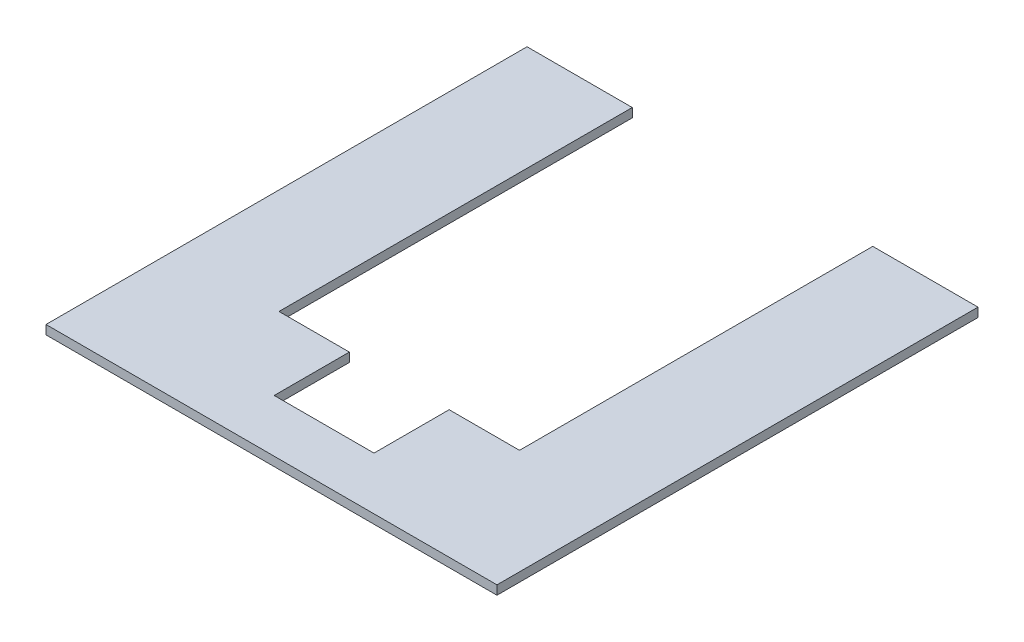
ISO-10303-21;
HEADER;
FILE_DESCRIPTION(('STEP AP214'),'2;1');
FILE_NAME('part.step','',(''),(''),'','','');
FILE_SCHEMA(('AUTOMOTIVE_DESIGN { 1 0 10303 214 1 1 1 1 }'));
ENDSEC;
DATA;
#1=APPLICATION_CONTEXT('core data for automotive mechanical design processes');
#2=APPLICATION_PROTOCOL_DEFINITION('international standard','automotive_design',2000,#1);
#3=PRODUCT_CONTEXT('',#1,'mechanical');
#4=PRODUCT('Part','Part','',(#3));
#5=PRODUCT_RELATED_PRODUCT_CATEGORY('part','',(#4));
#6=PRODUCT_DEFINITION_FORMATION('','',#4);
#7=PRODUCT_DEFINITION_CONTEXT('part definition',#1,'design');
#8=PRODUCT_DEFINITION('design','',#6,#7);
#9=PRODUCT_DEFINITION_SHAPE('','',#8);
#10=(LENGTH_UNIT() NAMED_UNIT(*) SI_UNIT(.MILLI.,.METRE.));
#11=(NAMED_UNIT(*) PLANE_ANGLE_UNIT() SI_UNIT($,.RADIAN.));
#12=(NAMED_UNIT(*) SI_UNIT($,.STERADIAN.) SOLID_ANGLE_UNIT());
#13=UNCERTAINTY_MEASURE_WITH_UNIT(LENGTH_MEASURE(1.E-05),#10,'distance_accuracy_value','');
#14=(GEOMETRIC_REPRESENTATION_CONTEXT(3) GLOBAL_UNCERTAINTY_ASSIGNED_CONTEXT((#13)) GLOBAL_UNIT_ASSIGNED_CONTEXT((#10,
#11,#12)) REPRESENTATION_CONTEXT('',''));
#15=CARTESIAN_POINT('',(0.,0.,0.));
#16=DIRECTION('',(0.,0.,1.));
#17=DIRECTION('',(1.,0.,0.));
#18=AXIS2_PLACEMENT_3D('',#15,#16,#17);
#19=CARTESIAN_POINT('',(0.,0.,32.5));
#20=DIRECTION('',(0.,0.,-1.));
#21=DIRECTION('',(-1.,0.,0.));
#22=AXIS2_PLACEMENT_3D('',#19,#20,#21);
#23=PLANE('',#22);
#24=DIRECTION('',(0.,1.,0.));
#25=VECTOR('',#24,1.);
#26=CARTESIAN_POINT('',(16.6,0.,32.5));
#27=LINE('',#26,#25);
#28=CARTESIAN_POINT('',(16.6,0.,32.5));
#29=VERTEX_POINT('',#28);
#30=CARTESIAN_POINT('',(16.6,3.,32.5));
#31=VERTEX_POINT('',#30);
#32=EDGE_CURVE('E146',#29,#31,#27,.T.);
#33=ORIENTED_EDGE('',*,*,#32,.T.);
#34=DIRECTION('',(1.,0.,0.));
#35=VECTOR('',#34,1.);
#36=CARTESIAN_POINT('',(40.,3.,32.5));
#37=LINE('',#36,#35);
#38=CARTESIAN_POINT('',(40.,3.,32.5));
#39=VERTEX_POINT('',#38);
#40=EDGE_CURVE('E134',#31,#39,#37,.T.);
#41=ORIENTED_EDGE('',*,*,#40,.T.);
#42=DIRECTION('',(0.,-1.,0.));
#43=VECTOR('',#42,1.);
#44=CARTESIAN_POINT('',(40.,3.,32.5));
#45=LINE('',#44,#43);
#46=CARTESIAN_POINT('',(40.,0.,32.5));
#47=VERTEX_POINT('',#46);
#48=EDGE_CURVE('E142',#39,#47,#45,.T.);
#49=ORIENTED_EDGE('',*,*,#48,.T.);
#50=DIRECTION('',(-1.,0.,0.));
#51=VECTOR('',#50,1.);
#52=CARTESIAN_POINT('',(40.,0.,32.5));
#53=LINE('',#52,#51);
#54=EDGE_CURVE('E138',#47,#29,#53,.T.);
#55=ORIENTED_EDGE('',*,*,#54,.T.);
#56=EDGE_LOOP('',(#33,#41,#49,#55));
#57=FACE_BOUND('',#56,.T.);
#58=ADVANCED_FACE('F33',(#57),#23,.T.);
#59=CARTESIAN_POINT('',(75.,3.,-75.));
#60=DIRECTION('',(-1.,0.,0.));
#61=DIRECTION('',(0.,0.,1.));
#62=AXIS2_PLACEMENT_3D('',#59,#60,#61);
#63=PLANE('',#62);
#64=DIRECTION('',(0.,0.,-1.));
#65=VECTOR('',#64,1.);
#66=CARTESIAN_POINT('',(75.,0.,-75.));
#67=LINE('',#66,#65);
#68=CARTESIAN_POINT('',(75.,0.,75.));
#69=VERTEX_POINT('',#68);
#70=CARTESIAN_POINT('',(75.,0.,-85.));
#71=VERTEX_POINT('',#70);
#72=EDGE_CURVE('E84',#69,#71,#67,.T.);
#73=ORIENTED_EDGE('',*,*,#72,.T.);
#74=DIRECTION('',(0.,-1.,0.));
#75=VECTOR('',#74,1.);
#76=CARTESIAN_POINT('',(75.,3.,-85.));
#77=LINE('',#76,#75);
#78=CARTESIAN_POINT('',(75.,3.,-85.));
#79=VERTEX_POINT('',#78);
#80=EDGE_CURVE('E117',#79,#71,#77,.T.);
#81=ORIENTED_EDGE('',*,*,#80,.F.);
#82=DIRECTION('',(0.,0.,-1.));
#83=VECTOR('',#82,1.);
#84=CARTESIAN_POINT('',(75.,3.,-75.));
#85=LINE('',#84,#83);
#86=CARTESIAN_POINT('',(75.,3.,75.));
#87=VERTEX_POINT('',#86);
#88=EDGE_CURVE('E77',#87,#79,#85,.T.);
#89=ORIENTED_EDGE('',*,*,#88,.F.);
#90=DIRECTION('',(0.,-1.,0.));
#91=VECTOR('',#90,1.);
#92=CARTESIAN_POINT('',(75.,3.,75.));
#93=LINE('',#92,#91);
#94=EDGE_CURVE('E41',#87,#69,#93,.T.);
#95=ORIENTED_EDGE('',*,*,#94,.T.);
#96=EDGE_LOOP('',(#73,#81,#89,#95));
#97=FACE_BOUND('',#96,.T.);
#98=ADVANCED_FACE('F35',(#97),#63,.F.);
#99=CARTESIAN_POINT('',(-75.,3.,-75.));
#100=DIRECTION('',(1.,0.,0.));
#101=DIRECTION('',(0.,0.,-1.));
#102=AXIS2_PLACEMENT_3D('',#99,#100,#101);
#103=PLANE('',#102);
#104=DIRECTION('',(0.,0.,1.));
#105=VECTOR('',#104,1.);
#106=CARTESIAN_POINT('',(-75.,0.,-75.));
#107=LINE('',#106,#105);
#108=CARTESIAN_POINT('',(-75.,0.,-85.));
#109=VERTEX_POINT('',#108);
#110=CARTESIAN_POINT('',(-75.,0.,75.));
#111=VERTEX_POINT('',#110);
#112=EDGE_CURVE('E78',#109,#111,#107,.T.);
#113=ORIENTED_EDGE('',*,*,#112,.T.);
#114=DIRECTION('',(0.,-1.,0.));
#115=VECTOR('',#114,1.);
#116=CARTESIAN_POINT('',(-75.,3.,75.));
#117=LINE('',#116,#115);
#118=CARTESIAN_POINT('',(-75.,3.,75.));
#119=VERTEX_POINT('',#118);
#120=EDGE_CURVE('E11',#119,#111,#117,.T.);
#121=ORIENTED_EDGE('',*,*,#120,.F.);
#122=DIRECTION('',(0.,0.,1.));
#123=VECTOR('',#122,1.);
#124=CARTESIAN_POINT('',(-75.,3.,-75.));
#125=LINE('',#124,#123);
#126=CARTESIAN_POINT('',(-75.,3.,-85.));
#127=VERTEX_POINT('',#126);
#128=EDGE_CURVE('E99',#127,#119,#125,.T.);
#129=ORIENTED_EDGE('',*,*,#128,.F.);
#130=DIRECTION('',(0.,1.,0.));
#131=VECTOR('',#130,1.);
#132=CARTESIAN_POINT('',(-75.,3.,-85.));
#133=LINE('',#132,#131);
#134=EDGE_CURVE('E122',#109,#127,#133,.T.);
#135=ORIENTED_EDGE('',*,*,#134,.F.);
#136=EDGE_LOOP('',(#113,#121,#129,#135));
#137=FACE_BOUND('',#136,.T.);
#138=ADVANCED_FACE('F239',(#137),#103,.F.);
#139=CARTESIAN_POINT('',(-75.,3.,75.));
#140=DIRECTION('',(0.,0.,-1.));
#141=DIRECTION('',(-1.,0.,0.));
#142=AXIS2_PLACEMENT_3D('',#139,#140,#141);
#143=PLANE('',#142);
#144=DIRECTION('',(1.,0.,0.));
#145=VECTOR('',#144,1.);
#146=CARTESIAN_POINT('',(-75.,0.,75.));
#147=LINE('',#146,#145);
#148=EDGE_CURVE('E69',#111,#69,#147,.T.);
#149=ORIENTED_EDGE('',*,*,#148,.T.);
#150=ORIENTED_EDGE('',*,*,#94,.F.);
#151=DIRECTION('',(1.,0.,0.));
#152=VECTOR('',#151,1.);
#153=CARTESIAN_POINT('',(-75.,3.,75.));
#154=LINE('',#153,#152);
#155=EDGE_CURVE('E57',#119,#87,#154,.T.);
#156=ORIENTED_EDGE('',*,*,#155,.F.);
#157=ORIENTED_EDGE('',*,*,#120,.T.);
#158=EDGE_LOOP('',(#149,#150,#156,#157));
#159=FACE_BOUND('',#158,.T.);
#160=ADVANCED_FACE('F71',(#159),#143,.F.);
#161=CARTESIAN_POINT('',(0.,3.,0.));
#162=DIRECTION('',(0.,1.,0.));
#163=DIRECTION('',(0.,0.,1.));
#164=AXIS2_PLACEMENT_3D('',#161,#162,#163);
#165=PLANE('',#164);
#166=DIRECTION('',(0.,0.,-1.));
#167=VECTOR('',#166,1.);
#168=CARTESIAN_POINT('',(16.6,3.,32.5));
#169=LINE('',#168,#167);
#170=CARTESIAN_POINT('',(16.6,3.,57.5));
#171=VERTEX_POINT('',#170);
#172=EDGE_CURVE('E164',#171,#31,#169,.T.);
#173=ORIENTED_EDGE('',*,*,#172,.F.);
#174=DIRECTION('',(1.,0.,0.));
#175=VECTOR('',#174,1.);
#176=CARTESIAN_POINT('',(16.6,3.,57.5));
#177=LINE('',#176,#175);
#178=CARTESIAN_POINT('',(-16.6,3.,57.5));
#179=VERTEX_POINT('',#178);
#180=EDGE_CURVE('E157',#179,#171,#177,.T.);
#181=ORIENTED_EDGE('',*,*,#180,.F.);
#182=DIRECTION('',(0.,0.,1.));
#183=VECTOR('',#182,1.);
#184=CARTESIAN_POINT('',(-16.6,3.,32.5));
#185=LINE('',#184,#183);
#186=CARTESIAN_POINT('',(-16.6,3.,32.5));
#187=VERTEX_POINT('',#186);
#188=EDGE_CURVE('E161',#187,#179,#185,.T.);
#189=ORIENTED_EDGE('',*,*,#188,.F.);
#190=CARTESIAN_POINT('',(-40.,3.,32.5));
#191=VERTEX_POINT('',#190);
#192=EDGE_CURVE('E131',#191,#187,#37,.T.);
#193=ORIENTED_EDGE('',*,*,#192,.F.);
#194=DIRECTION('',(0.,0.,1.));
#195=VECTOR('',#194,1.);
#196=CARTESIAN_POINT('',(-40.,3.,-75.));
#197=LINE('',#196,#195);
#198=CARTESIAN_POINT('',(-40.,3.,-85.));
#199=VERTEX_POINT('',#198);
#200=EDGE_CURVE('E105',#199,#191,#197,.T.);
#201=ORIENTED_EDGE('',*,*,#200,.F.);
#202=DIRECTION('',(1.,0.,0.));
#203=VECTOR('',#202,1.);
#204=CARTESIAN_POINT('',(-40.,3.,-85.));
#205=LINE('',#204,#203);
#206=EDGE_CURVE('E119',#127,#199,#205,.T.);
#207=ORIENTED_EDGE('',*,*,#206,.F.);
#208=ORIENTED_EDGE('',*,*,#128,.T.);
#209=ORIENTED_EDGE('',*,*,#155,.T.);
#210=ORIENTED_EDGE('',*,*,#88,.T.);
#211=DIRECTION('',(1.,0.,0.));
#212=VECTOR('',#211,1.);
#213=CARTESIAN_POINT('',(75.,3.,-85.));
#214=LINE('',#213,#212);
#215=CARTESIAN_POINT('',(40.,3.,-85.));
#216=VERTEX_POINT('',#215);
#217=EDGE_CURVE('E107',#216,#79,#214,.T.);
#218=ORIENTED_EDGE('',*,*,#217,.F.);
#219=DIRECTION('',(0.,0.,-1.));
#220=VECTOR('',#219,1.);
#221=CARTESIAN_POINT('',(40.,3.,-75.));
#222=LINE('',#221,#220);
#223=EDGE_CURVE('E102',#39,#216,#222,.T.);
#224=ORIENTED_EDGE('',*,*,#223,.F.);
#225=ORIENTED_EDGE('',*,*,#40,.F.);
#226=EDGE_LOOP('',(#173,#181,#189,#193,#201,#207,#208,#209,#210,#218,#224,#225));
#227=FACE_BOUND('',#226,.T.);
#228=ADVANCED_FACE('F216',(#227),#165,.T.);
#229=CARTESIAN_POINT('',(0.,0.,0.));
#230=DIRECTION('',(0.,1.,0.));
#231=DIRECTION('',(0.,0.,1.));
#232=AXIS2_PLACEMENT_3D('',#229,#230,#231);
#233=PLANE('',#232);
#234=DIRECTION('',(1.,0.,0.));
#235=VECTOR('',#234,1.);
#236=CARTESIAN_POINT('',(16.6,0.,57.5));
#237=LINE('',#236,#235);
#238=CARTESIAN_POINT('',(-16.6,0.,57.5));
#239=VERTEX_POINT('',#238);
#240=CARTESIAN_POINT('',(16.6,0.,57.5));
#241=VERTEX_POINT('',#240);
#242=EDGE_CURVE('E150',#239,#241,#237,.T.);
#243=ORIENTED_EDGE('',*,*,#242,.T.);
#244=DIRECTION('',(0.,0.,-1.));
#245=VECTOR('',#244,1.);
#246=CARTESIAN_POINT('',(16.6,0.,32.5));
#247=LINE('',#246,#245);
#248=EDGE_CURVE('E160',#241,#29,#247,.T.);
#249=ORIENTED_EDGE('',*,*,#248,.T.);
#250=ORIENTED_EDGE('',*,*,#54,.F.);
#251=DIRECTION('',(0.,0.,-1.));
#252=VECTOR('',#251,1.);
#253=CARTESIAN_POINT('',(40.,0.,-75.));
#254=LINE('',#253,#252);
#255=CARTESIAN_POINT('',(40.,0.,-85.));
#256=VERTEX_POINT('',#255);
#257=EDGE_CURVE('E92',#47,#256,#254,.T.);
#258=ORIENTED_EDGE('',*,*,#257,.T.);
#259=DIRECTION('',(-1.,0.,0.));
#260=VECTOR('',#259,1.);
#261=CARTESIAN_POINT('',(75.,0.,-85.));
#262=LINE('',#261,#260);
#263=EDGE_CURVE('E90',#71,#256,#262,.T.);
#264=ORIENTED_EDGE('',*,*,#263,.F.);
#265=ORIENTED_EDGE('',*,*,#72,.F.);
#266=ORIENTED_EDGE('',*,*,#148,.F.);
#267=ORIENTED_EDGE('',*,*,#112,.F.);
#268=DIRECTION('',(-1.,0.,0.));
#269=VECTOR('',#268,1.);
#270=CARTESIAN_POINT('',(-40.,0.,-85.));
#271=LINE('',#270,#269);
#272=CARTESIAN_POINT('',(-40.,0.,-85.));
#273=VERTEX_POINT('',#272);
#274=EDGE_CURVE('E125',#273,#109,#271,.T.);
#275=ORIENTED_EDGE('',*,*,#274,.F.);
#276=DIRECTION('',(0.,0.,1.));
#277=VECTOR('',#276,1.);
#278=CARTESIAN_POINT('',(-40.,0.,-75.));
#279=LINE('',#278,#277);
#280=CARTESIAN_POINT('',(-40.,0.,32.5));
#281=VERTEX_POINT('',#280);
#282=EDGE_CURVE('E95',#273,#281,#279,.T.);
#283=ORIENTED_EDGE('',*,*,#282,.T.);
#284=CARTESIAN_POINT('',(-16.6,0.,32.5));
#285=VERTEX_POINT('',#284);
#286=EDGE_CURVE('E141',#285,#281,#53,.T.);
#287=ORIENTED_EDGE('',*,*,#286,.F.);
#288=DIRECTION('',(0.,0.,1.));
#289=VECTOR('',#288,1.);
#290=CARTESIAN_POINT('',(-16.6,0.,32.5));
#291=LINE('',#290,#289);
#292=EDGE_CURVE('E48',#285,#239,#291,.T.);
#293=ORIENTED_EDGE('',*,*,#292,.T.);
#294=EDGE_LOOP('',(#243,#249,#250,#258,#264,#265,#266,#267,#275,#283,#287,#293));
#295=FACE_BOUND('',#294,.T.);
#296=ADVANCED_FACE('F87',(#295),#233,.F.);
#297=CARTESIAN_POINT('',(-40.,0.,-75.));
#298=DIRECTION('',(-1.,0.,0.));
#299=DIRECTION('',(0.,0.,1.));
#300=AXIS2_PLACEMENT_3D('',#297,#298,#299);
#301=PLANE('',#300);
#302=ORIENTED_EDGE('',*,*,#200,.T.);
#303=DIRECTION('',(0.,1.,0.));
#304=VECTOR('',#303,1.);
#305=CARTESIAN_POINT('',(-40.,3.,32.5));
#306=LINE('',#305,#304);
#307=EDGE_CURVE('E135',#281,#191,#306,.T.);
#308=ORIENTED_EDGE('',*,*,#307,.F.);
#309=ORIENTED_EDGE('',*,*,#282,.F.);
#310=DIRECTION('',(0.,-1.,0.));
#311=VECTOR('',#310,1.);
#312=CARTESIAN_POINT('',(-40.,3.,-85.));
#313=LINE('',#312,#311);
#314=EDGE_CURVE('E128',#199,#273,#313,.T.);
#315=ORIENTED_EDGE('',*,*,#314,.F.);
#316=EDGE_LOOP('',(#302,#308,#309,#315));
#317=FACE_BOUND('',#316,.T.);
#318=ADVANCED_FACE('F230',(#317),#301,.F.);
#319=CARTESIAN_POINT('',(40.,0.,-75.));
#320=DIRECTION('',(1.,0.,0.));
#321=DIRECTION('',(0.,0.,-1.));
#322=AXIS2_PLACEMENT_3D('',#319,#320,#321);
#323=PLANE('',#322);
#324=ORIENTED_EDGE('',*,*,#223,.T.);
#325=DIRECTION('',(0.,1.,0.));
#326=VECTOR('',#325,1.);
#327=CARTESIAN_POINT('',(40.,3.,-85.));
#328=LINE('',#327,#326);
#329=EDGE_CURVE('E113',#256,#216,#328,.T.);
#330=ORIENTED_EDGE('',*,*,#329,.F.);
#331=ORIENTED_EDGE('',*,*,#257,.F.);
#332=ORIENTED_EDGE('',*,*,#48,.F.);
#333=EDGE_LOOP('',(#324,#330,#331,#332));
#334=FACE_BOUND('',#333,.T.);
#335=ADVANCED_FACE('F192',(#334),#323,.F.);
#336=CARTESIAN_POINT('',(0.,0.,-85.));
#337=DIRECTION('',(0.,0.,-1.));
#338=DIRECTION('',(-1.,0.,0.));
#339=AXIS2_PLACEMENT_3D('',#336,#337,#338);
#340=PLANE('',#339);
#341=ORIENTED_EDGE('',*,*,#80,.T.);
#342=ORIENTED_EDGE('',*,*,#263,.T.);
#343=ORIENTED_EDGE('',*,*,#329,.T.);
#344=ORIENTED_EDGE('',*,*,#217,.T.);
#345=EDGE_LOOP('',(#341,#342,#343,#344));
#346=FACE_BOUND('',#345,.T.);
#347=ADVANCED_FACE('F218',(#346),#340,.T.);
#348=CARTESIAN_POINT('',(0.,0.,-85.));
#349=DIRECTION('',(0.,0.,-1.));
#350=DIRECTION('',(-1.,0.,0.));
#351=AXIS2_PLACEMENT_3D('',#348,#349,#350);
#352=PLANE('',#351);
#353=ORIENTED_EDGE('',*,*,#314,.T.);
#354=ORIENTED_EDGE('',*,*,#274,.T.);
#355=ORIENTED_EDGE('',*,*,#134,.T.);
#356=ORIENTED_EDGE('',*,*,#206,.T.);
#357=EDGE_LOOP('',(#353,#354,#355,#356));
#358=FACE_BOUND('',#357,.T.);
#359=ADVANCED_FACE('F220',(#358),#352,.T.);
#360=DIRECTION('',(0.,1.,0.));
#361=VECTOR('',#360,1.);
#362=CARTESIAN_POINT('',(-16.6,0.,32.5));
#363=LINE('',#362,#361);
#364=EDGE_CURVE('E149',#285,#187,#363,.T.);
#365=ORIENTED_EDGE('',*,*,#364,.F.);
#366=ORIENTED_EDGE('',*,*,#286,.T.);
#367=ORIENTED_EDGE('',*,*,#307,.T.);
#368=ORIENTED_EDGE('',*,*,#192,.T.);
#369=EDGE_LOOP('',(#365,#366,#367,#368));
#370=FACE_BOUND('',#369,.T.);
#371=ADVANCED_FACE('F226',(#370),#23,.T.);
#372=CARTESIAN_POINT('',(16.6,0.,32.5));
#373=DIRECTION('',(1.,0.,0.));
#374=DIRECTION('',(0.,0.,-1.));
#375=AXIS2_PLACEMENT_3D('',#372,#373,#374);
#376=PLANE('',#375);
#377=ORIENTED_EDGE('',*,*,#172,.T.);
#378=ORIENTED_EDGE('',*,*,#32,.F.);
#379=ORIENTED_EDGE('',*,*,#248,.F.);
#380=DIRECTION('',(0.,1.,0.));
#381=VECTOR('',#380,1.);
#382=CARTESIAN_POINT('',(16.6,0.,57.5));
#383=LINE('',#382,#381);
#384=EDGE_CURVE('E145',#241,#171,#383,.T.);
#385=ORIENTED_EDGE('',*,*,#384,.T.);
#386=EDGE_LOOP('',(#377,#378,#379,#385));
#387=FACE_BOUND('',#386,.T.);
#388=ADVANCED_FACE('F242',(#387),#376,.F.);
#389=CARTESIAN_POINT('',(16.6,0.,57.5));
#390=DIRECTION('',(0.,0.,1.));
#391=DIRECTION('',(1.,0.,0.));
#392=AXIS2_PLACEMENT_3D('',#389,#390,#391);
#393=PLANE('',#392);
#394=ORIENTED_EDGE('',*,*,#180,.T.);
#395=ORIENTED_EDGE('',*,*,#384,.F.);
#396=ORIENTED_EDGE('',*,*,#242,.F.);
#397=DIRECTION('',(0.,1.,0.));
#398=VECTOR('',#397,1.);
#399=CARTESIAN_POINT('',(-16.6,0.,57.5));
#400=LINE('',#399,#398);
#401=EDGE_CURVE('E152',#239,#179,#400,.T.);
#402=ORIENTED_EDGE('',*,*,#401,.T.);
#403=EDGE_LOOP('',(#394,#395,#396,#402));
#404=FACE_BOUND('',#403,.T.);
#405=ADVANCED_FACE('F249',(#404),#393,.F.);
#406=CARTESIAN_POINT('',(-16.6,0.,32.5));
#407=DIRECTION('',(-1.,0.,0.));
#408=DIRECTION('',(0.,0.,1.));
#409=AXIS2_PLACEMENT_3D('',#406,#407,#408);
#410=PLANE('',#409);
#411=ORIENTED_EDGE('',*,*,#188,.T.);
#412=ORIENTED_EDGE('',*,*,#401,.F.);
#413=ORIENTED_EDGE('',*,*,#292,.F.);
#414=ORIENTED_EDGE('',*,*,#364,.T.);
#415=EDGE_LOOP('',(#411,#412,#413,#414));
#416=FACE_BOUND('',#415,.T.);
#417=ADVANCED_FACE('F263',(#416),#410,.F.);
#418=CLOSED_SHELL('',(#58,#98,#138,#160,#228,#296,#318,#335,#347,#359,#371,#388,#405,#417));
#419=MANIFOLD_SOLID_BREP('B2',#418);
#420=ADVANCED_BREP_SHAPE_REPRESENTATION('',(#18,#419),#14);
#421=SHAPE_DEFINITION_REPRESENTATION(#9,#420);
ENDSEC;
END-ISO-10303-21;
